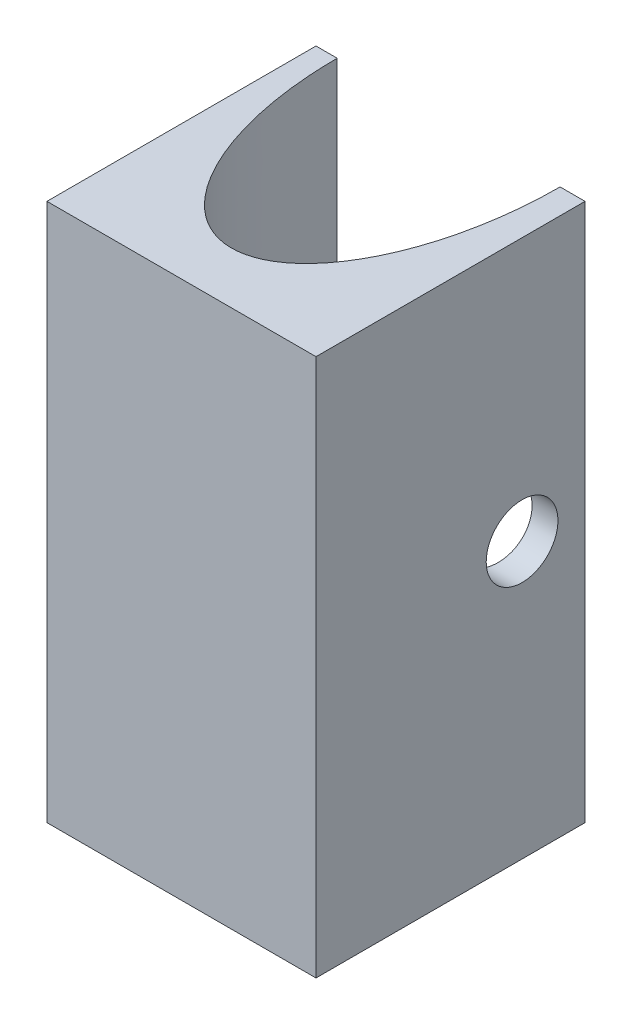
ISO-10303-21;
HEADER;
FILE_DESCRIPTION(('STEP AP214'),'2;1');
FILE_NAME('part.step','',(''),(''),'','','');
FILE_SCHEMA(('AUTOMOTIVE_DESIGN { 1 0 10303 214 1 1 1 1 }'));
ENDSEC;
DATA;
#1=APPLICATION_CONTEXT('core data for automotive mechanical design processes');
#2=APPLICATION_PROTOCOL_DEFINITION('international standard','automotive_design',2000,#1);
#3=PRODUCT_CONTEXT('',#1,'mechanical');
#4=PRODUCT('Part','Part','',(#3));
#5=PRODUCT_RELATED_PRODUCT_CATEGORY('part','',(#4));
#6=PRODUCT_DEFINITION_FORMATION('','',#4);
#7=PRODUCT_DEFINITION_CONTEXT('part definition',#1,'design');
#8=PRODUCT_DEFINITION('design','',#6,#7);
#9=PRODUCT_DEFINITION_SHAPE('','',#8);
#10=(LENGTH_UNIT() NAMED_UNIT(*) SI_UNIT(.MILLI.,.METRE.));
#11=(NAMED_UNIT(*) PLANE_ANGLE_UNIT() SI_UNIT($,.RADIAN.));
#12=(NAMED_UNIT(*) SI_UNIT($,.STERADIAN.) SOLID_ANGLE_UNIT());
#13=UNCERTAINTY_MEASURE_WITH_UNIT(LENGTH_MEASURE(1.E-05),#10,'distance_accuracy_value','');
#14=(GEOMETRIC_REPRESENTATION_CONTEXT(3) GLOBAL_UNCERTAINTY_ASSIGNED_CONTEXT((#13)) GLOBAL_UNIT_ASSIGNED_CONTEXT((#10,
#11,#12)) REPRESENTATION_CONTEXT('',''));
#15=CARTESIAN_POINT('',(0.,0.,0.));
#16=DIRECTION('',(0.,0.,1.));
#17=DIRECTION('',(1.,0.,0.));
#18=AXIS2_PLACEMENT_3D('',#15,#16,#17);
#19=CARTESIAN_POINT('',(-48.6482195834382,30.,19.1282152689936));
#20=DIRECTION('',(0.,0.,1.));
#21=DIRECTION('',(1.,0.,0.));
#22=AXIS2_PLACEMENT_3D('',#19,#20,#21);
#23=PLANE('',#22);
#24=DIRECTION('',(-1.,0.,0.));
#25=VECTOR('',#24,1.);
#26=CARTESIAN_POINT('',(-48.6482195834382,30.,19.1282152689936));
#27=LINE('',#26,#25);
#28=CARTESIAN_POINT('',(-47.465612351514,30.,19.1282152689936));
#29=VERTEX_POINT('',#28);
#30=CARTESIAN_POINT('',(-48.6482195834382,30.,19.1282152689936));
#31=VERTEX_POINT('',#30);
#32=EDGE_CURVE('E74',#29,#31,#27,.T.);
#33=ORIENTED_EDGE('',*,*,#32,.F.);
#34=DIRECTION('',(0.,-1.,0.));
#35=VECTOR('',#34,1.);
#36=CARTESIAN_POINT('',(-47.465612351514,30.,19.1282152689936));
#37=LINE('',#36,#35);
#38=CARTESIAN_POINT('',(-47.465612351514,0.,19.1282152689936));
#39=VERTEX_POINT('',#38);
#40=EDGE_CURVE('E111',#29,#39,#37,.T.);
#41=ORIENTED_EDGE('',*,*,#40,.T.);
#42=DIRECTION('',(-1.,0.,0.));
#43=VECTOR('',#42,1.);
#44=CARTESIAN_POINT('',(-48.6482195834382,0.,19.1282152689936));
#45=LINE('',#44,#43);
#46=CARTESIAN_POINT('',(-48.6482195834382,0.,19.1282152689936));
#47=VERTEX_POINT('',#46);
#48=EDGE_CURVE('E96',#39,#47,#45,.T.);
#49=ORIENTED_EDGE('',*,*,#48,.T.);
#50=DIRECTION('',(0.,-1.,0.));
#51=VECTOR('',#50,1.);
#52=CARTESIAN_POINT('',(-48.6482195834382,30.,19.1282152689936));
#53=LINE('',#52,#51);
#54=EDGE_CURVE('E124',#31,#47,#53,.T.);
#55=ORIENTED_EDGE('',*,*,#54,.F.);
#56=EDGE_LOOP('',(#33,#41,#49,#55));
#57=FACE_BOUND('',#56,.T.);
#58=ADVANCED_FACE('F43',(#57),#23,.F.);
#59=CARTESIAN_POINT('',(-48.6482195834382,30.,19.1282152689936));
#60=DIRECTION('',(1.,0.,0.));
#61=DIRECTION('',(0.,0.,-1.));
#62=AXIS2_PLACEMENT_3D('',#59,#60,#61);
#63=PLANE('',#62);
#64=CARTESIAN_POINT('',(-48.6482195834382,15.3460062906579,22.639015201529));
#65=DIRECTION('',(-1.,0.,0.));
#66=DIRECTION('',(0.,0.,1.));
#67=AXIS2_PLACEMENT_3D('',#64,#65,#66);
#68=CIRCLE('',#67,2.);
#69=CARTESIAN_POINT('',(-48.6482195834382,15.3460062906579,24.639015201529));
#70=VERTEX_POINT('',#69);
#71=EDGE_CURVE('E165',#70,#70,#68,.T.);
#72=ORIENTED_EDGE('',*,*,#71,.F.);
#73=EDGE_LOOP('',(#72));
#74=FACE_BOUND('',#73,.T.);
#75=DIRECTION('',(0.,0.,1.));
#76=VECTOR('',#75,1.);
#77=CARTESIAN_POINT('',(-48.6482195834382,0.,19.1282152689936));
#78=LINE('',#77,#76);
#79=CARTESIAN_POINT('',(-48.6482195834382,0.,34.1282152689936));
#80=VERTEX_POINT('',#79);
#81=EDGE_CURVE('E115',#47,#80,#78,.T.);
#82=ORIENTED_EDGE('',*,*,#81,.T.);
#83=DIRECTION('',(0.,-1.,0.));
#84=VECTOR('',#83,1.);
#85=CARTESIAN_POINT('',(-48.6482195834382,30.,34.1282152689936));
#86=LINE('',#85,#84);
#87=CARTESIAN_POINT('',(-48.6482195834382,30.,34.1282152689936));
#88=VERTEX_POINT('',#87);
#89=EDGE_CURVE('E58',#88,#80,#86,.T.);
#90=ORIENTED_EDGE('',*,*,#89,.F.);
#91=DIRECTION('',(0.,0.,1.));
#92=VECTOR('',#91,1.);
#93=CARTESIAN_POINT('',(-48.6482195834382,30.,19.1282152689936));
#94=LINE('',#93,#92);
#95=EDGE_CURVE('E147',#31,#88,#94,.T.);
#96=ORIENTED_EDGE('',*,*,#95,.F.);
#97=ORIENTED_EDGE('',*,*,#54,.T.);
#98=EDGE_LOOP('',(#82,#90,#96,#97));
#99=FACE_BOUND('',#98,.T.);
#100=ADVANCED_FACE('F45',(#74,#99),#63,.F.);
#101=CARTESIAN_POINT('',(-48.6482195834382,30.,34.1282152689936));
#102=DIRECTION('',(0.,0.,-1.));
#103=DIRECTION('',(-1.,0.,0.));
#104=AXIS2_PLACEMENT_3D('',#101,#102,#103);
#105=PLANE('',#104);
#106=DIRECTION('',(1.,0.,0.));
#107=VECTOR('',#106,1.);
#108=CARTESIAN_POINT('',(-48.6482195834382,0.,34.1282152689936));
#109=LINE('',#108,#107);
#110=CARTESIAN_POINT('',(-33.6482195834382,0.,34.1282152689936));
#111=VERTEX_POINT('',#110);
#112=EDGE_CURVE('E137',#80,#111,#109,.T.);
#113=ORIENTED_EDGE('',*,*,#112,.T.);
#114=DIRECTION('',(0.,-1.,0.));
#115=VECTOR('',#114,1.);
#116=CARTESIAN_POINT('',(-33.6482195834382,30.,34.1282152689936));
#117=LINE('',#116,#115);
#118=CARTESIAN_POINT('',(-33.6482195834382,30.,34.1282152689936));
#119=VERTEX_POINT('',#118);
#120=EDGE_CURVE('E154',#119,#111,#117,.T.);
#121=ORIENTED_EDGE('',*,*,#120,.F.);
#122=DIRECTION('',(1.,0.,0.));
#123=VECTOR('',#122,1.);
#124=CARTESIAN_POINT('',(-48.6482195834382,30.,34.1282152689936));
#125=LINE('',#124,#123);
#126=EDGE_CURVE('E104',#88,#119,#125,.T.);
#127=ORIENTED_EDGE('',*,*,#126,.F.);
#128=ORIENTED_EDGE('',*,*,#89,.T.);
#129=EDGE_LOOP('',(#113,#121,#127,#128));
#130=FACE_BOUND('',#129,.T.);
#131=ADVANCED_FACE('F186',(#130),#105,.F.);
#132=CARTESIAN_POINT('',(-33.6482195834382,30.,19.1282152689936));
#133=DIRECTION('',(-1.,0.,0.));
#134=DIRECTION('',(0.,0.,1.));
#135=AXIS2_PLACEMENT_3D('',#132,#133,#134);
#136=PLANE('',#135);
#137=CARTESIAN_POINT('',(-33.6482195834382,15.3460062906579,22.6390152015289));
#138=DIRECTION('',(-1.,0.,0.));
#139=DIRECTION('',(0.,0.,1.));
#140=AXIS2_PLACEMENT_3D('',#137,#138,#139);
#141=CIRCLE('',#140,2.);
#142=CARTESIAN_POINT('',(-33.6482195834382,15.3460062906579,24.6390152015289));
#143=VERTEX_POINT('',#142);
#144=EDGE_CURVE('E122',#143,#143,#141,.T.);
#145=ORIENTED_EDGE('',*,*,#144,.T.);
#146=EDGE_LOOP('',(#145));
#147=FACE_BOUND('',#146,.T.);
#148=DIRECTION('',(0.,0.,-1.));
#149=VECTOR('',#148,1.);
#150=CARTESIAN_POINT('',(-33.6482195834382,0.,19.1282152689936));
#151=LINE('',#150,#149);
#152=CARTESIAN_POINT('',(-33.6482195834382,0.,19.1282152689936));
#153=VERTEX_POINT('',#152);
#154=EDGE_CURVE('E140',#111,#153,#151,.T.);
#155=ORIENTED_EDGE('',*,*,#154,.T.);
#156=DIRECTION('',(0.,-1.,0.));
#157=VECTOR('',#156,1.);
#158=CARTESIAN_POINT('',(-33.6482195834382,30.,19.1282152689936));
#159=LINE('',#158,#157);
#160=CARTESIAN_POINT('',(-33.6482195834382,30.,19.1282152689936));
#161=VERTEX_POINT('',#160);
#162=EDGE_CURVE('E150',#161,#153,#159,.T.);
#163=ORIENTED_EDGE('',*,*,#162,.F.);
#164=DIRECTION('',(0.,0.,-1.));
#165=VECTOR('',#164,1.);
#166=CARTESIAN_POINT('',(-33.6482195834382,30.,19.1282152689936));
#167=LINE('',#166,#165);
#168=EDGE_CURVE('E127',#119,#161,#167,.T.);
#169=ORIENTED_EDGE('',*,*,#168,.F.);
#170=ORIENTED_EDGE('',*,*,#120,.T.);
#171=EDGE_LOOP('',(#155,#163,#169,#170));
#172=FACE_BOUND('',#171,.T.);
#173=ADVANCED_FACE('F191',(#147,#172),#136,.F.);
#174=CARTESIAN_POINT('',(-35.0400120063584,0.,19.1282152689936));
#175=VERTEX_POINT('',#174);
#176=EDGE_CURVE('E143',#153,#175,#45,.T.);
#177=ORIENTED_EDGE('',*,*,#176,.T.);
#178=DIRECTION('',(0.,-1.,0.));
#179=VECTOR('',#178,1.);
#180=CARTESIAN_POINT('',(-35.0400120063584,30.,19.1282152689936));
#181=LINE('',#180,#179);
#182=CARTESIAN_POINT('',(-35.0400120063584,30.,19.1282152689936));
#183=VERTEX_POINT('',#182);
#184=EDGE_CURVE('E66',#175,#183,#181,.F.);
#185=ORIENTED_EDGE('',*,*,#184,.T.);
#186=EDGE_CURVE('E120',#161,#183,#27,.T.);
#187=ORIENTED_EDGE('',*,*,#186,.F.);
#188=ORIENTED_EDGE('',*,*,#162,.T.);
#189=EDGE_LOOP('',(#177,#185,#187,#188));
#190=FACE_BOUND('',#189,.T.);
#191=ADVANCED_FACE('F182',(#190),#23,.F.);
#192=CARTESIAN_POINT('',(0.,30.,0.));
#193=DIRECTION('',(0.,1.,0.));
#194=DIRECTION('',(0.,0.,1.));
#195=AXIS2_PLACEMENT_3D('',#192,#193,#194);
#196=PLANE('',#195);
#197=CARTESIAN_POINT('',(-41.2528121789362,30.,19.1282152689936));
#198=DIRECTION('',(0.,-1.,0.));
#199=DIRECTION('',(0.,0.,1.));
#200=AXIS2_PLACEMENT_3D('',#197,#198,#199);
#201=ELLIPSE('',#200,12.1125334614594,6.2128001725778);
#202=EDGE_CURVE('E113',#183,#29,#201,.T.);
#203=ORIENTED_EDGE('',*,*,#202,.T.);
#204=ORIENTED_EDGE('',*,*,#32,.T.);
#205=ORIENTED_EDGE('',*,*,#95,.T.);
#206=ORIENTED_EDGE('',*,*,#126,.T.);
#207=ORIENTED_EDGE('',*,*,#168,.T.);
#208=ORIENTED_EDGE('',*,*,#186,.T.);
#209=EDGE_LOOP('',(#203,#204,#205,#206,#207,#208));
#210=FACE_BOUND('',#209,.T.);
#211=ADVANCED_FACE('F118',(#210),#196,.T.);
#212=CARTESIAN_POINT('',(0.,0.,0.));
#213=DIRECTION('',(0.,1.,0.));
#214=DIRECTION('',(0.,0.,1.));
#215=AXIS2_PLACEMENT_3D('',#212,#213,#214);
#216=PLANE('',#215);
#217=ORIENTED_EDGE('',*,*,#48,.F.);
#218=CARTESIAN_POINT('',(-41.2528121789362,0.,19.1282152689936));
#219=DIRECTION('',(0.,-1.,0.));
#220=DIRECTION('',(0.,0.,1.));
#221=AXIS2_PLACEMENT_3D('',#218,#219,#220);
#222=ELLIPSE('',#221,12.1125334614594,6.2128001725778);
#223=EDGE_CURVE('E11',#39,#175,#222,.F.);
#224=ORIENTED_EDGE('',*,*,#223,.T.);
#225=ORIENTED_EDGE('',*,*,#176,.F.);
#226=ORIENTED_EDGE('',*,*,#154,.F.);
#227=ORIENTED_EDGE('',*,*,#112,.F.);
#228=ORIENTED_EDGE('',*,*,#81,.F.);
#229=EDGE_LOOP('',(#217,#224,#225,#226,#227,#228));
#230=FACE_BOUND('',#229,.T.);
#231=ADVANCED_FACE('F197',(#230),#216,.F.);
#232=DIRECTION('',(0.,-1.,0.));
#233=VECTOR('',#232,1.);
#234=SURFACE_OF_LINEAR_EXTRUSION('',#201,#233);
#235=CARTESIAN_POINT('',(-35.720261264252,15.3460062906579,24.6390152015289));
#236=CARTESIAN_POINT('',(-35.7202615046015,15.2910077443182,24.6390157388174));
#237=CARTESIAN_POINT('',(-35.7196659908705,15.2360171907134,24.6367453352175));
#238=CARTESIAN_POINT('',(-35.7172953909037,15.1264293829985,24.6276852292124));
#239=CARTESIAN_POINT('',(-35.7155202470863,15.071832148219,24.6208953061945));
#240=CARTESIAN_POINT('',(-35.7108194012423,14.9633910018713,24.6028451271519));
#241=CARTESIAN_POINT('',(-35.7078929002825,14.9095476403448,24.5915817669328));
#242=CARTESIAN_POINT('',(-35.7009404797965,14.8030061049442,24.5646776645453));
#243=CARTESIAN_POINT('',(-35.6969136738235,14.7503088915647,24.5490333926979));
#244=CARTESIAN_POINT('',(-35.6833007383563,14.5947609351139,24.495786857139));
#245=CARTESIAN_POINT('',(-35.6721682802686,14.4941468640787,24.4518192276447));
#246=CARTESIAN_POINT('',(-35.6464923828069,14.3017815328634,24.3482652308348));
#247=CARTESIAN_POINT('',(-35.6319481982794,14.2100322150193,24.2886754511583));
#248=CARTESIAN_POINT('',(-35.6081000614554,14.0800809718949,24.1883726605229));
#249=CARTESIAN_POINT('',(-35.599726529126,14.0376943627755,24.1527441754781));
#250=CARTESIAN_POINT('',(-35.5824507455433,13.9561142782018,24.0781992805169));
#251=CARTESIAN_POINT('',(-35.5735490200369,13.9169177166918,24.0392861242775));
#252=CARTESIAN_POINT('',(-35.5462098386489,13.8043965727263,23.917918850896));
#253=CARTESIAN_POINT('',(-35.5271351216793,13.7361230958327,23.8308234262091));
#254=CARTESIAN_POINT('',(-35.4877474808657,13.6132975425631,23.6442705981454));
#255=CARTESIAN_POINT('',(-35.467415072421,13.5591623074624,23.5445444177314));
#256=CARTESIAN_POINT('',(-35.4269204795755,13.4684747871322,23.3373414312789));
#257=CARTESIAN_POINT('',(-35.4067583072969,13.4319237438325,23.2298640784098));
#258=CARTESIAN_POINT('',(-35.3672243694614,13.3772159483587,23.0090509745945));
#259=CARTESIAN_POINT('',(-35.3478620394636,13.3592389797644,22.8956689219634));
#260=CARTESIAN_POINT('',(-35.3107960680511,13.3429302022745,22.6672292564982));
#261=CARTESIAN_POINT('',(-35.2930923561067,13.3445975576597,22.5521717151516));
#262=CARTESIAN_POINT('',(-35.2599471452944,13.3675832523138,22.3246854346929));
#263=CARTESIAN_POINT('',(-35.2444881055713,13.3887385325506,22.2122428086519));
#264=CARTESIAN_POINT('',(-35.2159172915161,13.450003633863,21.9923319082975));
#265=CARTESIAN_POINT('',(-35.2028053456583,13.490112069062,21.8848632709112));
#266=CARTESIAN_POINT('',(-35.1791601648775,13.5875589699888,21.6795342780997));
#267=CARTESIAN_POINT('',(-35.1685945548789,13.644657914525,21.5815639413694));
#268=CARTESIAN_POINT('',(-35.1497335107673,13.7746989853634,21.3965262905121));
#269=CARTESIAN_POINT('',(-35.141437967114,13.847640346898,21.309458450404));
#270=CARTESIAN_POINT('',(-35.12698798244,14.0066123368666,21.1495083366827));
#271=CARTESIAN_POINT('',(-35.1208159130555,14.0925262334228,21.0765115963563));
#272=CARTESIAN_POINT('',(-35.1102744325261,14.2754566300646,20.9459257930296));
#273=CARTESIAN_POINT('',(-35.1059049932281,14.3724729567252,20.8883364894051));
#274=CARTESIAN_POINT('',(-35.0987342433017,14.5745814666338,20.790371601418));
#275=CARTESIAN_POINT('',(-35.0959289282987,14.6796522367079,20.7499521237611));
#276=CARTESIAN_POINT('',(-35.0916708178358,14.8951048339571,20.6872788672055));
#277=CARTESIAN_POINT('',(-35.0902180210424,15.0054866558956,20.6650250703963));
#278=CARTESIAN_POINT('',(-35.0885460110521,15.2284221196679,20.6393243058086));
#279=CARTESIAN_POINT('',(-35.0883267394865,15.3409756584861,20.6358764481589));
#280=CARTESIAN_POINT('',(-35.0891025593887,15.5650657545575,20.6478841018233));
#281=CARTESIAN_POINT('',(-35.0900976517722,15.6766023110436,20.6633396273911));
#282=CARTESIAN_POINT('',(-35.0933865413897,15.8955068635812,20.7127130737018));
#283=CARTESIAN_POINT('',(-35.0956805067013,16.0028743182182,20.7466333838134));
#284=CARTESIAN_POINT('',(-35.1017401324273,16.2103756364826,20.8319596493437));
#285=CARTESIAN_POINT('',(-35.1055057859692,16.3105095338862,20.8833655231089));
#286=CARTESIAN_POINT('',(-35.1147389084958,16.5006838213062,21.0021624336492));
#287=CARTESIAN_POINT('',(-35.1202060530467,16.5907261310992,21.0695504224341));
#288=CARTESIAN_POINT('',(-35.1330882101097,16.7581931962719,21.2183551433023));
#289=CARTESIAN_POINT('',(-35.1405032056098,16.8356180618389,21.2997717528619));
#290=CARTESIAN_POINT('',(-35.1574947976966,16.9757103960444,21.4742881105111));
#291=CARTESIAN_POINT('',(-35.1670721312667,17.0383728183284,21.5673918370715));
#292=CARTESIAN_POINT('',(-35.1885120880978,17.1471959497318,21.7625458654026));
#293=CARTESIAN_POINT('',(-35.2003747233706,17.1933565721118,21.8645962141964));
#294=CARTESIAN_POINT('',(-35.2264292071784,17.268114992175,22.075084778697));
#295=CARTESIAN_POINT('',(-35.240629481008,17.2966474182353,22.1835451560467));
#296=CARTESIAN_POINT('',(-35.2711607894648,17.3352149152005,22.4034107712662));
#297=CARTESIAN_POINT('',(-35.2874919331082,17.3452490393277,22.5148161595714));
#298=CARTESIAN_POINT('',(-35.3221121125887,17.3466878249935,22.7385788110564));
#299=CARTESIAN_POINT('',(-35.3404190096142,17.3379061647417,22.8509345183148));
#300=CARTESIAN_POINT('',(-35.3783120806143,17.3017162648938,23.0723682979554));
#301=CARTESIAN_POINT('',(-35.3978983676118,17.2743063776403,23.1814460795155));
#302=CARTESIAN_POINT('',(-35.4379233130375,17.2011503586839,23.3948724879153));
#303=CARTESIAN_POINT('',(-35.4583699110596,17.1551615645013,23.499137339996));
#304=CARTESIAN_POINT('',(-35.4887877076191,17.0734932691163,23.6484803971374));
#305=CARTESIAN_POINT('',(-35.4988869549321,17.0441491675936,23.6970947472886));
#306=CARTESIAN_POINT('',(-35.5188973445997,16.9813853113989,23.7917345519411));
#307=CARTESIAN_POINT('',(-35.5288082812568,16.9479613662053,23.8377572724102));
#308=CARTESIAN_POINT('',(-35.5581507691292,16.8415673380983,23.971808598344));
#309=CARTESIAN_POINT('',(-35.5771012253265,16.7627161874811,24.0553795903225));
#310=CARTESIAN_POINT('',(-35.6126079725966,16.5915672697512,24.2080006726649));
#311=CARTESIAN_POINT('',(-35.629164724044,16.4992720951627,24.2770535564191));
#312=CARTESIAN_POINT('',(-35.6513167707132,16.3534096978236,24.3677066133706));
#313=CARTESIAN_POINT('',(-35.6582195024176,16.3038764143879,24.3956380818895));
#314=CARTESIAN_POINT('',(-35.6710714220661,16.202543869576,24.4472099460316));
#315=CARTESIAN_POINT('',(-35.6770214343875,16.1507466171392,24.4708540538317));
#316=CARTESIAN_POINT('',(-35.6878636097695,16.0452777522677,24.5136502182659));
#317=CARTESIAN_POINT('',(-35.6927567108772,15.9916078514348,24.5328062595115));
#318=CARTESIAN_POINT('',(-35.7014038142883,15.8827515789427,24.5664877995223));
#319=CARTESIAN_POINT('',(-35.7051579046287,15.8275653248461,24.5810136561708));
#320=CARTESIAN_POINT('',(-35.7122514368904,15.7020193435562,24.6083693149217));
#321=CARTESIAN_POINT('',(-35.7152478044357,15.6313414532634,24.6198485450548));
#322=CARTESIAN_POINT('',(-35.7192525386019,15.4891066168888,24.6351710498323));
#323=CARTESIAN_POINT('',(-35.7202609515996,15.4175496913531,24.6390145026115));
#324=CARTESIAN_POINT('',(-35.720261264252,15.3460062906579,24.6390152015289));
#325=B_SPLINE_CURVE_WITH_KNOTS('',3,(#235,#236,#237,#238,#239,#240,#241,#242,#243,#244,#245,
#246,#247,#248,#249,#250,#251,#252,#253,#254,#255,#256,#257,#258,#259,#260,#261,#262,#263,#264,
#265,#266,#267,#268,#269,#270,#271,#272,#273,#274,#275,#276,#277,#278,#279,#280,#281,#282,#283,
#284,#285,#286,#287,#288,#289,#290,#291,#292,#293,#294,#295,#296,#297,#298,#299,#300,#301,#302,
#303,#304,#305,#306,#307,#308,#309,#310,#311,#312,#313,#314,#315,#316,#317,#318,#319,#320,#321,
#322,#323,#324),.UNSPECIFIED.,.T.,.F.,(4,2,2,2,2,2,2,2,2,2,2,2,2,2,2,2,2,2,2,2,2,2,2,2,2,2,2,2,
2,2,2,2,2,2,2,2,2,2,2,2,2,2,2,2,4),(0.,0.164931517058101,0.329871085561821,0.494925308977931,
0.660112900287879,0.989565102213637,1.31908932673852,1.48692481394172,1.65459595767443,
1.98987218029417,2.3341351752354,2.67842248108981,3.02601187719311,3.37358648602095,
3.71827903390729,4.06294638137505,4.40296813513131,4.74297347851834,5.08008395777193,
5.4171891719278,5.75342734007421,6.08966517670671,6.42588710289083,6.76210928259937,
7.09837498027045,7.43463910768172,7.77083915679453,8.10703626973712,8.44334814119614,
8.77966178040688,9.11721521982112,9.4547859353722,9.79571485625791,10.1366739360606,
10.4822382621758,10.6550897155773,10.8281202275815,11.1756932548788,11.5231993452583,
11.6948711953173,11.86639368744,12.0377633158474,12.2091196952765,12.4236714913393,
12.6382182820724),.UNSPECIFIED.);
#326=CARTESIAN_POINT('',(-35.720261264252,15.3460062906579,24.6390152015289));
#327=VERTEX_POINT('',#326);
#328=EDGE_CURVE('E47',#327,#327,#325,.T.);
#329=ORIENTED_EDGE('',*,*,#328,.T.);
#330=EDGE_LOOP('',(#329));
#331=FACE_BOUND('',#330,.T.);
#332=CARTESIAN_POINT('',(-46.7853630936204,15.3460062906579,24.639015201529));
#333=CARTESIAN_POINT('',(-46.7853628532708,15.4010048369975,24.6390157388174));
#334=CARTESIAN_POINT('',(-46.7859583670019,15.4559953906023,24.6367453352175));
#335=CARTESIAN_POINT('',(-46.7883289669687,15.5655831983172,24.6276852292124));
#336=CARTESIAN_POINT('',(-46.790104110786,15.6201804330967,24.6208953061945));
#337=CARTESIAN_POINT('',(-46.7948049566301,15.7286215794444,24.6028451271519));
#338=CARTESIAN_POINT('',(-46.7977314575898,15.7824649409709,24.5915817669328));
#339=CARTESIAN_POINT('',(-46.8046838780759,15.8890064763715,24.5646776645453));
#340=CARTESIAN_POINT('',(-46.8087106840489,15.9417036897511,24.5490333926979));
#341=CARTESIAN_POINT('',(-46.822323619516,16.0972516462018,24.495786857139));
#342=CARTESIAN_POINT('',(-46.8334560776037,16.197865717237,24.4518192276447));
#343=CARTESIAN_POINT('',(-46.8591319750654,16.3902310484523,24.3482652308348));
#344=CARTESIAN_POINT('',(-46.8736761595929,16.4819803662964,24.2886754511583));
#345=CARTESIAN_POINT('',(-46.897524296417,16.6119316094208,24.1883726605229));
#346=CARTESIAN_POINT('',(-46.9058978287463,16.6543182185402,24.1527441754781));
#347=CARTESIAN_POINT('',(-46.9231736123291,16.7358983031139,24.0781992805169));
#348=CARTESIAN_POINT('',(-46.9320753378355,16.7750948646239,24.0392861242775));
#349=CARTESIAN_POINT('',(-46.9594145192235,16.8876160085894,23.917918850896));
#350=CARTESIAN_POINT('',(-46.978489236193,16.955889485483,23.8308234262091));
#351=CARTESIAN_POINT('',(-47.0178768770066,17.0787150387526,23.6442705981454));
#352=CARTESIAN_POINT('',(-47.0382092854514,17.1328502738533,23.5445444177314));
#353=CARTESIAN_POINT('',(-47.0787038782968,17.2235377941835,23.337341431279));
#354=CARTESIAN_POINT('',(-47.0988660505754,17.2600888374832,23.2298640784098));
#355=CARTESIAN_POINT('',(-47.138399988411,17.314796632957,23.0090509745945));
#356=CARTESIAN_POINT('',(-47.1577623184087,17.3327736015513,22.8956689219634));
#357=CARTESIAN_POINT('',(-47.1948282898213,17.3490823790412,22.6672292564982));
#358=CARTESIAN_POINT('',(-47.2125320017656,17.347415023656,22.5521717151516));
#359=CARTESIAN_POINT('',(-47.245677212578,17.3244293290019,22.3246854346929));
#360=CARTESIAN_POINT('',(-47.261136252301,17.3032740487651,22.2122428086519));
#361=CARTESIAN_POINT('',(-47.2897070663563,17.2420089474527,21.9923319082975));
#362=CARTESIAN_POINT('',(-47.3028190122141,17.2019005122537,21.8848632709112));
#363=CARTESIAN_POINT('',(-47.3264641929949,17.1044536113269,21.6795342780997));
#364=CARTESIAN_POINT('',(-47.3370298029934,17.0473546667907,21.5815639413694));
#365=CARTESIAN_POINT('',(-47.355890847105,16.9173135959523,21.3965262905121));
#366=CARTESIAN_POINT('',(-47.3641863907583,16.8443722344177,21.309458450404));
#367=CARTESIAN_POINT('',(-47.3786363754324,16.6854002444492,21.1495083366827));
#368=CARTESIAN_POINT('',(-47.3848084448168,16.5994863478929,21.0765115963563));
#369=CARTESIAN_POINT('',(-47.3953499253463,16.4165559512511,20.9459257930296));
#370=CARTESIAN_POINT('',(-47.3997193646443,16.3195396245905,20.8883364894052));
#371=CARTESIAN_POINT('',(-47.4068901145707,16.1174311146819,20.790371601418));
#372=CARTESIAN_POINT('',(-47.4096954295736,16.0123603446078,20.7499521237611));
#373=CARTESIAN_POINT('',(-47.4139535400365,15.7969077473587,20.6872788672055));
#374=CARTESIAN_POINT('',(-47.41540633683,15.6865259254201,20.6650250703963));
#375=CARTESIAN_POINT('',(-47.4170783468203,15.4635904616478,20.6393243058086));
#376=CARTESIAN_POINT('',(-47.4172976183858,15.3510369228296,20.635876448159));
#377=CARTESIAN_POINT('',(-47.4165217984836,15.1269468267582,20.6478841018233));
#378=CARTESIAN_POINT('',(-47.4155267061002,15.0154102702721,20.6633396273911));
#379=CARTESIAN_POINT('',(-47.4122378164826,14.7965057177346,20.7127130737018));
#380=CARTESIAN_POINT('',(-47.409943851171,14.6891382630975,20.7466333838134));
#381=CARTESIAN_POINT('',(-47.4038842254451,14.4816369448331,20.8319596493437));
#382=CARTESIAN_POINT('',(-47.4001185719031,14.3815030474295,20.8833655231089));
#383=CARTESIAN_POINT('',(-47.3908854493766,14.1913287600096,21.0021624336492));
#384=CARTESIAN_POINT('',(-47.3854183048256,14.1012864502165,21.0695504224341));
#385=CARTESIAN_POINT('',(-47.3725361477627,13.9338193850438,21.2183551433023));
#386=CARTESIAN_POINT('',(-47.3651211522626,13.8563945194768,21.2997717528619));
#387=CARTESIAN_POINT('',(-47.3481295601757,13.7163021852713,21.4742881105111));
#388=CARTESIAN_POINT('',(-47.3385522266056,13.6536397629873,21.5673918370716));
#389=CARTESIAN_POINT('',(-47.3171122697746,13.5448166315839,21.7625458654026));
#390=CARTESIAN_POINT('',(-47.3052496345017,13.4986560092039,21.8645962141964));
#391=CARTESIAN_POINT('',(-47.279195150694,13.4238975891407,22.0750847786971));
#392=CARTESIAN_POINT('',(-47.2649948768644,13.3953651630804,22.1835451560467));
#393=CARTESIAN_POINT('',(-47.2344635684076,13.3567976661152,22.4034107712663));
#394=CARTESIAN_POINT('',(-47.2181324247642,13.346763541988,22.5148161595714));
#395=CARTESIAN_POINT('',(-47.1835122452836,13.3453247563222,22.7385788110564));
#396=CARTESIAN_POINT('',(-47.1652053482582,13.354106416574,22.8509345183148));
#397=CARTESIAN_POINT('',(-47.1273122772581,13.3902963164219,23.0723682979554));
#398=CARTESIAN_POINT('',(-47.1077259902605,13.4177062036754,23.1814460795155));
#399=CARTESIAN_POINT('',(-47.0677010448349,13.4908622226318,23.3948724879153));
#400=CARTESIAN_POINT('',(-47.0472544468128,13.5368510168145,23.4991373399961));
#401=CARTESIAN_POINT('',(-47.0168366502532,13.6185193121994,23.6484803971374));
#402=CARTESIAN_POINT('',(-47.0067374029402,13.6478634137221,23.6970947472886));
#403=CARTESIAN_POINT('',(-46.9867270132727,13.7106272699168,23.7917345519411));
#404=CARTESIAN_POINT('',(-46.9768160766156,13.7440512151104,23.8377572724102));
#405=CARTESIAN_POINT('',(-46.9474735887431,13.8504452432174,23.971808598344));
#406=CARTESIAN_POINT('',(-46.9285231325459,13.9292963938346,24.0553795903225));
#407=CARTESIAN_POINT('',(-46.8930163852757,14.1004453115646,24.2080006726649));
#408=CARTESIAN_POINT('',(-46.8764596338284,14.192740486153,24.2770535564191));
#409=CARTESIAN_POINT('',(-46.8543075871591,14.3386028834921,24.3677066133706));
#410=CARTESIAN_POINT('',(-46.8474048554548,14.3881361669278,24.3956380818895));
#411=CARTESIAN_POINT('',(-46.8345529358062,14.4894687117397,24.4472099460317));
#412=CARTESIAN_POINT('',(-46.8286029234848,14.5412659641765,24.4708540538317));
#413=CARTESIAN_POINT('',(-46.8177607481028,14.646734829048,24.5136502182659));
#414=CARTESIAN_POINT('',(-46.8128676469952,14.7004047298809,24.5328062595115));
#415=CARTESIAN_POINT('',(-46.8042205435841,14.809261002373,24.5664877995223));
#416=CARTESIAN_POINT('',(-46.8004664532436,14.8644472564696,24.5810136561708));
#417=CARTESIAN_POINT('',(-46.793372920982,14.9899932377595,24.6083693149217));
#418=CARTESIAN_POINT('',(-46.7903765534367,15.0606711280523,24.6198485450548));
#419=CARTESIAN_POINT('',(-46.7863718192705,15.2029059644269,24.6351710498323));
#420=CARTESIAN_POINT('',(-46.7853634062727,15.2744628899626,24.6390145026115));
#421=CARTESIAN_POINT('',(-46.7853630936204,15.3460062906579,24.639015201529));
#422=B_SPLINE_CURVE_WITH_KNOTS('',3,(#332,#333,#334,#335,#336,#337,#338,#339,#340,#341,#342,
#343,#344,#345,#346,#347,#348,#349,#350,#351,#352,#353,#354,#355,#356,#357,#358,#359,#360,#361,
#362,#363,#364,#365,#366,#367,#368,#369,#370,#371,#372,#373,#374,#375,#376,#377,#378,#379,#380,
#381,#382,#383,#384,#385,#386,#387,#388,#389,#390,#391,#392,#393,#394,#395,#396,#397,#398,#399,
#400,#401,#402,#403,#404,#405,#406,#407,#408,#409,#410,#411,#412,#413,#414,#415,#416,#417,#418,
#419,#420,#421),.UNSPECIFIED.,.T.,.F.,(4,2,2,2,2,2,2,2,2,2,2,2,2,2,2,2,2,2,2,2,2,2,2,2,2,2,2,2,
2,2,2,2,2,2,2,2,2,2,2,2,2,2,2,2,4),(0.,0.164931517058099,0.329871085561817,0.494925308977927,
0.66011290028788,0.989565102213638,1.31908932673852,1.48692481394172,1.65459595767443,
1.98987218029418,2.33413517523541,2.67842248108981,3.02601187719311,3.37358648602094,
3.71827903390729,4.06294638137505,4.40296813513132,4.74297347851835,5.08008395777193,
5.4171891719278,5.75342734007422,6.08966517670671,6.42588710289083,6.76210928259938,
7.09837498027046,7.43463910768173,7.77083915679454,8.10703626973713,8.44334814119614,
8.77966178040689,9.11721521982113,9.45478593537221,9.79571485625793,10.1366739360606,
10.4822382621758,10.6550897155773,10.8281202275815,11.1756932548789,11.5231993452583,
11.6948711953173,11.86639368744,12.0377633158474,12.2091196952765,12.4236714913393,
12.6382182820724),.UNSPECIFIED.);
#423=CARTESIAN_POINT('',(-46.7853630936204,15.3460062906579,24.639015201529));
#424=VERTEX_POINT('',#423);
#425=EDGE_CURVE('E159',#424,#424,#422,.T.);
#426=ORIENTED_EDGE('',*,*,#425,.T.);
#427=EDGE_LOOP('',(#426));
#428=FACE_BOUND('',#427,.T.);
#429=ORIENTED_EDGE('',*,*,#202,.F.);
#430=ORIENTED_EDGE('',*,*,#184,.F.);
#431=ORIENTED_EDGE('',*,*,#223,.F.);
#432=ORIENTED_EDGE('',*,*,#40,.F.);
#433=EDGE_LOOP('',(#429,#430,#431,#432));
#434=FACE_BOUND('',#433,.T.);
#435=ADVANCED_FACE('F112',(#331,#428,#434),#234,.F.);
#436=CARTESIAN_POINT('',(-18.6482195834382,15.3460062906579,22.6390152015289));
#437=DIRECTION('',(-1.,0.,0.));
#438=DIRECTION('',(0.,0.,1.));
#439=AXIS2_PLACEMENT_3D('',#436,#437,#438);
#440=CYLINDRICAL_SURFACE('',#439,2.);
#441=ORIENTED_EDGE('',*,*,#71,.T.);
#442=EDGE_LOOP('',(#441));
#443=FACE_BOUND('',#442,.T.);
#444=ORIENTED_EDGE('',*,*,#425,.F.);
#445=EDGE_LOOP('',(#444));
#446=FACE_BOUND('',#445,.T.);
#447=ADVANCED_FACE('F171',(#443,#446),#440,.F.);
#448=ORIENTED_EDGE('',*,*,#328,.F.);
#449=EDGE_LOOP('',(#448));
#450=FACE_BOUND('',#449,.T.);
#451=ORIENTED_EDGE('',*,*,#144,.F.);
#452=EDGE_LOOP('',(#451));
#453=FACE_BOUND('',#452,.T.);
#454=ADVANCED_FACE('F168',(#450,#453),#440,.F.);
#455=CLOSED_SHELL('',(#58,#100,#131,#173,#191,#211,#231,#435,#447,#454));
#456=MANIFOLD_SOLID_BREP('B2',#455);
#457=ADVANCED_BREP_SHAPE_REPRESENTATION('',(#18,#456),#14);
#458=SHAPE_DEFINITION_REPRESENTATION(#9,#457);
ENDSEC;
END-ISO-10303-21;
